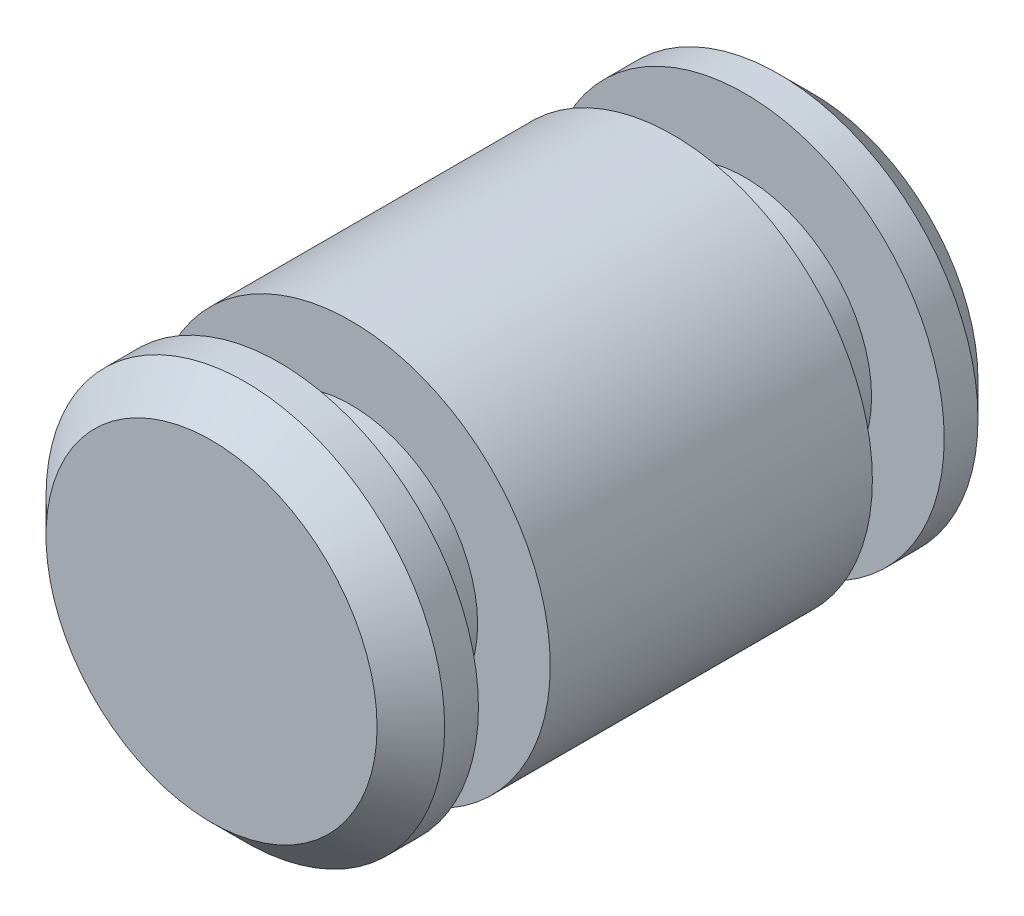
ISO-10303-21;
HEADER;
FILE_DESCRIPTION(('STEP AP214'),'2;1');
FILE_NAME('part.step','',(''),(''),'','','');
FILE_SCHEMA(('AUTOMOTIVE_DESIGN { 1 0 10303 214 1 1 1 1 }'));
ENDSEC;
DATA;
#1=APPLICATION_CONTEXT('core data for automotive mechanical design processes');
#2=APPLICATION_PROTOCOL_DEFINITION('international standard','automotive_design',2000,#1);
#3=PRODUCT_CONTEXT('',#1,'mechanical');
#4=PRODUCT('Part','Part','',(#3));
#5=PRODUCT_RELATED_PRODUCT_CATEGORY('part','',(#4));
#6=PRODUCT_DEFINITION_FORMATION('','',#4);
#7=PRODUCT_DEFINITION_CONTEXT('part definition',#1,'design');
#8=PRODUCT_DEFINITION('design','',#6,#7);
#9=PRODUCT_DEFINITION_SHAPE('','',#8);
#10=(LENGTH_UNIT() NAMED_UNIT(*) SI_UNIT(.MILLI.,.METRE.));
#11=(NAMED_UNIT(*) PLANE_ANGLE_UNIT() SI_UNIT($,.RADIAN.));
#12=(NAMED_UNIT(*) SI_UNIT($,.STERADIAN.) SOLID_ANGLE_UNIT());
#13=UNCERTAINTY_MEASURE_WITH_UNIT(LENGTH_MEASURE(1.E-05),#10,'distance_accuracy_value','');
#14=(GEOMETRIC_REPRESENTATION_CONTEXT(3) GLOBAL_UNCERTAINTY_ASSIGNED_CONTEXT((#13)) GLOBAL_UNIT_ASSIGNED_CONTEXT((#10,
#11,#12)) REPRESENTATION_CONTEXT('',''));
#15=CARTESIAN_POINT('',(0.,0.,0.));
#16=DIRECTION('',(0.,0.,1.));
#17=DIRECTION('',(1.,0.,0.));
#18=AXIS2_PLACEMENT_3D('',#15,#16,#17);
#19=CARTESIAN_POINT('',(0.,0.,2.2590125));
#20=DIRECTION('',(0.,0.,-1.));
#21=DIRECTION('',(-1.,0.,0.));
#22=AXIS2_PLACEMENT_3D('',#19,#20,#21);
#23=CYLINDRICAL_SURFACE('',#22,1.4986);
#24=CARTESIAN_POINT('',(0.,0.,-1.2110085));
#25=DIRECTION('',(0.,0.,1.));
#26=DIRECTION('',(1.,0.,0.));
#27=AXIS2_PLACEMENT_3D('',#24,#25,#26);
#28=CIRCLE('',#27,1.4986);
#29=CARTESIAN_POINT('',(1.4986,0.,-1.2110085));
#30=VERTEX_POINT('',#29);
#31=EDGE_CURVE('E74',#30,#30,#28,.T.);
#32=ORIENTED_EDGE('',*,*,#31,.T.);
#33=EDGE_LOOP('',(#32));
#34=FACE_BOUND('',#33,.T.);
#35=CARTESIAN_POINT('',(0.,0.,1.2110085));
#36=DIRECTION('',(0.,0.,1.));
#37=DIRECTION('',(1.,0.,0.));
#38=AXIS2_PLACEMENT_3D('',#35,#36,#37);
#39=CIRCLE('',#38,1.4986);
#40=CARTESIAN_POINT('',(1.4986,0.,1.2110085));
#41=VERTEX_POINT('',#40);
#42=EDGE_CURVE('E66',#41,#41,#39,.T.);
#43=ORIENTED_EDGE('',*,*,#42,.F.);
#44=EDGE_LOOP('',(#43));
#45=FACE_BOUND('',#44,.T.);
#46=ADVANCED_FACE('F32',(#34,#45),#23,.T.);
#47=CARTESIAN_POINT('',(0.,0.,2.0050125));
#48=DIRECTION('',(0.,0.,1.));
#49=DIRECTION('',(1.,0.,0.));
#50=AXIS2_PLACEMENT_3D('',#47,#48,#49);
#51=CIRCLE('',#50,1.4986);
#52=CARTESIAN_POINT('',(1.4986,0.,2.0050125));
#53=VERTEX_POINT('',#52);
#54=EDGE_CURVE('E10',#53,#53,#51,.F.);
#55=ORIENTED_EDGE('',*,*,#54,.T.);
#56=EDGE_LOOP('',(#55));
#57=FACE_BOUND('',#56,.T.);
#58=CARTESIAN_POINT('',(0.,0.,1.7510125));
#59=DIRECTION('',(0.,0.,1.));
#60=DIRECTION('',(1.,0.,0.));
#61=AXIS2_PLACEMENT_3D('',#58,#59,#60);
#62=CIRCLE('',#61,1.4986);
#63=CARTESIAN_POINT('',(1.4986,0.,1.7510125));
#64=VERTEX_POINT('',#63);
#65=EDGE_CURVE('E70',#64,#64,#62,.T.);
#66=ORIENTED_EDGE('',*,*,#65,.T.);
#67=EDGE_LOOP('',(#66));
#68=FACE_BOUND('',#67,.T.);
#69=ADVANCED_FACE('F100',(#57,#68),#23,.T.);
#70=CARTESIAN_POINT('',(0.,0.,2.2590125));
#71=DIRECTION('',(0.,0.,1.));
#72=DIRECTION('',(1.,0.,0.));
#73=AXIS2_PLACEMENT_3D('',#70,#71,#72);
#74=PLANE('',#73);
#75=CARTESIAN_POINT('',(0.,0.,2.2590125));
#76=DIRECTION('',(0.,0.,1.));
#77=DIRECTION('',(1.,0.,0.));
#78=AXIS2_PLACEMENT_3D('',#75,#76,#77);
#79=CIRCLE('',#78,1.2446);
#80=CARTESIAN_POINT('',(1.2446,0.,2.2590125));
#81=VERTEX_POINT('',#80);
#82=EDGE_CURVE('E40',#81,#81,#79,.T.);
#83=ORIENTED_EDGE('',*,*,#82,.T.);
#84=EDGE_LOOP('',(#83));
#85=FACE_BOUND('',#84,.T.);
#86=ADVANCED_FACE('F111',(#85),#74,.T.);
#87=CARTESIAN_POINT('',(0.,-1.49859999999995,1.7510125));
#88=DIRECTION('',(0.,0.,1.));
#89=DIRECTION('',(1.,0.,0.));
#90=AXIS2_PLACEMENT_3D('',#87,#88,#89);
#91=PLANE('',#90);
#92=ORIENTED_EDGE('',*,*,#65,.F.);
#93=EDGE_LOOP('',(#92));
#94=FACE_BOUND('',#93,.T.);
#95=CARTESIAN_POINT('',(0.,0.,1.7510125));
#96=DIRECTION('',(0.,0.,1.));
#97=DIRECTION('',(1.,0.,0.));
#98=AXIS2_PLACEMENT_3D('',#95,#96,#97);
#99=CIRCLE('',#98,0.9525);
#100=CARTESIAN_POINT('',(0.9525,0.,1.7510125));
#101=VERTEX_POINT('',#100);
#102=EDGE_CURVE('E58',#101,#101,#99,.T.);
#103=ORIENTED_EDGE('',*,*,#102,.T.);
#104=EDGE_LOOP('',(#103));
#105=FACE_BOUND('',#104,.T.);
#106=ADVANCED_FACE('F115',(#94,#105),#91,.F.);
#107=CARTESIAN_POINT('',(0.,0.,8.82803245544554));
#108=DIRECTION('',(0.,0.,1.));
#109=DIRECTION('',(1.,0.,0.));
#110=AXIS2_PLACEMENT_3D('',#107,#108,#109);
#111=CYLINDRICAL_SURFACE('',#110,0.9525);
#112=ORIENTED_EDGE('',*,*,#102,.F.);
#113=EDGE_LOOP('',(#112));
#114=FACE_BOUND('',#113,.T.);
#115=CARTESIAN_POINT('',(0.,0.,1.2110085));
#116=DIRECTION('',(0.,0.,1.));
#117=DIRECTION('',(1.,0.,0.));
#118=AXIS2_PLACEMENT_3D('',#115,#116,#117);
#119=CIRCLE('',#118,0.9525);
#120=CARTESIAN_POINT('',(0.9525,0.,1.2110085));
#121=VERTEX_POINT('',#120);
#122=EDGE_CURVE('E62',#121,#121,#119,.T.);
#123=ORIENTED_EDGE('',*,*,#122,.T.);
#124=EDGE_LOOP('',(#123));
#125=FACE_BOUND('',#124,.T.);
#126=ADVANCED_FACE('F122',(#114,#125),#111,.T.);
#127=CARTESIAN_POINT('',(-1.94289029309402E-13,-1.49859999999991,1.2110085));
#128=DIRECTION('',(0.,0.,-1.));
#129=DIRECTION('',(-1.,0.,0.));
#130=AXIS2_PLACEMENT_3D('',#127,#128,#129);
#131=PLANE('',#130);
#132=ORIENTED_EDGE('',*,*,#122,.F.);
#133=EDGE_LOOP('',(#132));
#134=FACE_BOUND('',#133,.T.);
#135=ORIENTED_EDGE('',*,*,#42,.T.);
#136=EDGE_LOOP('',(#135));
#137=FACE_BOUND('',#136,.T.);
#138=ADVANCED_FACE('F128',(#134,#137),#131,.F.);
#139=CARTESIAN_POINT('',(-3.88578058618805E-13,-1.49859999999994,-1.2110085));
#140=DIRECTION('',(0.,0.,1.));
#141=DIRECTION('',(1.,0.,0.));
#142=AXIS2_PLACEMENT_3D('',#139,#140,#141);
#143=PLANE('',#142);
#144=ORIENTED_EDGE('',*,*,#31,.F.);
#145=EDGE_LOOP('',(#144));
#146=FACE_BOUND('',#145,.T.);
#147=CARTESIAN_POINT('',(0.,0.,-1.2110085));
#148=DIRECTION('',(0.,0.,1.));
#149=DIRECTION('',(1.,0.,0.));
#150=AXIS2_PLACEMENT_3D('',#147,#148,#149);
#151=CIRCLE('',#150,0.9525);
#152=CARTESIAN_POINT('',(0.9525,0.,-1.2110085));
#153=VERTEX_POINT('',#152);
#154=EDGE_CURVE('E78',#153,#153,#151,.T.);
#155=ORIENTED_EDGE('',*,*,#154,.T.);
#156=EDGE_LOOP('',(#155));
#157=FACE_BOUND('',#156,.T.);
#158=ADVANCED_FACE('F134',(#146,#157),#143,.F.);
#159=CARTESIAN_POINT('',(0.,0.,8.82803245544554));
#160=DIRECTION('',(0.,0.,1.));
#161=DIRECTION('',(1.,0.,0.));
#162=AXIS2_PLACEMENT_3D('',#159,#160,#161);
#163=CYLINDRICAL_SURFACE('',#162,0.9525);
#164=ORIENTED_EDGE('',*,*,#154,.F.);
#165=EDGE_LOOP('',(#164));
#166=FACE_BOUND('',#165,.T.);
#167=CARTESIAN_POINT('',(0.,0.,-1.75101250000001));
#168=DIRECTION('',(0.,0.,1.));
#169=DIRECTION('',(1.,0.,0.));
#170=AXIS2_PLACEMENT_3D('',#167,#168,#169);
#171=CIRCLE('',#170,0.952499999999999);
#172=CARTESIAN_POINT('',(0.952499999999999,0.,-1.75101250000001));
#173=VERTEX_POINT('',#172);
#174=EDGE_CURVE('E82',#173,#173,#171,.T.);
#175=ORIENTED_EDGE('',*,*,#174,.T.);
#176=EDGE_LOOP('',(#175));
#177=FACE_BOUND('',#176,.T.);
#178=ADVANCED_FACE('F141',(#166,#177),#163,.T.);
#179=CARTESIAN_POINT('',(-3.88578058618805E-13,-1.49859999999994,-1.75101250000001));
#180=DIRECTION('',(0.,0.,-1.));
#181=DIRECTION('',(-1.,0.,0.));
#182=AXIS2_PLACEMENT_3D('',#179,#180,#181);
#183=PLANE('',#182);
#184=ORIENTED_EDGE('',*,*,#174,.F.);
#185=EDGE_LOOP('',(#184));
#186=FACE_BOUND('',#185,.T.);
#187=CARTESIAN_POINT('',(0.,0.,-1.75101250000001));
#188=DIRECTION('',(0.,0.,1.));
#189=DIRECTION('',(1.,0.,0.));
#190=AXIS2_PLACEMENT_3D('',#187,#188,#189);
#191=CIRCLE('',#190,1.4986);
#192=CARTESIAN_POINT('',(1.4986,0.,-1.75101250000001));
#193=VERTEX_POINT('',#192);
#194=EDGE_CURVE('E86',#193,#193,#191,.T.);
#195=ORIENTED_EDGE('',*,*,#194,.T.);
#196=EDGE_LOOP('',(#195));
#197=FACE_BOUND('',#196,.T.);
#198=ADVANCED_FACE('F92',(#186,#197),#183,.F.);
#199=CARTESIAN_POINT('',(0.,0.,-2.25901249999999));
#200=DIRECTION('',(0.,0.,1.));
#201=DIRECTION('',(1.,0.,0.));
#202=AXIS2_PLACEMENT_3D('',#199,#200,#201);
#203=PLANE('',#202);
#204=CARTESIAN_POINT('',(0.,0.,-2.25901249999999));
#205=DIRECTION('',(0.,0.,1.));
#206=DIRECTION('',(1.,0.,0.));
#207=AXIS2_PLACEMENT_3D('',#204,#205,#206);
#208=CIRCLE('',#207,1.2446);
#209=CARTESIAN_POINT('',(1.2446,0.,-2.25901249999999));
#210=VERTEX_POINT('',#209);
#211=EDGE_CURVE('E46',#210,#210,#208,.F.);
#212=ORIENTED_EDGE('',*,*,#211,.T.);
#213=EDGE_LOOP('',(#212));
#214=FACE_BOUND('',#213,.T.);
#215=ADVANCED_FACE('F97',(#214),#203,.F.);
#216=CARTESIAN_POINT('',(0.,0.,-2.0050125));
#217=DIRECTION('',(0.,0.,1.));
#218=DIRECTION('',(1.,0.,0.));
#219=AXIS2_PLACEMENT_3D('',#216,#217,#218);
#220=CIRCLE('',#219,1.4986);
#221=CARTESIAN_POINT('',(1.4986,0.,-2.0050125));
#222=VERTEX_POINT('',#221);
#223=EDGE_CURVE('E52',#222,#222,#220,.T.);
#224=ORIENTED_EDGE('',*,*,#223,.T.);
#225=EDGE_LOOP('',(#224));
#226=FACE_BOUND('',#225,.T.);
#227=ORIENTED_EDGE('',*,*,#194,.F.);
#228=EDGE_LOOP('',(#227));
#229=FACE_BOUND('',#228,.T.);
#230=ADVANCED_FACE('F94',(#226,#229),#23,.T.);
#231=CARTESIAN_POINT('',(0.,0.,-2.0050125));
#232=DIRECTION('',(0.,0.,1.));
#233=DIRECTION('',(1.,0.,0.));
#234=AXIS2_PLACEMENT_3D('',#231,#232,#233);
#235=CONICAL_SURFACE('',#234,1.4986,0.785398163397449);
#236=ORIENTED_EDGE('',*,*,#211,.F.);
#237=EDGE_LOOP('',(#236));
#238=FACE_BOUND('',#237,.T.);
#239=ORIENTED_EDGE('',*,*,#223,.F.);
#240=EDGE_LOOP('',(#239));
#241=FACE_BOUND('',#240,.T.);
#242=ADVANCED_FACE('F96',(#238,#241),#235,.T.);
#243=CARTESIAN_POINT('',(0.,0.,2.2590125));
#244=DIRECTION('',(0.,0.,-1.));
#245=DIRECTION('',(-1.,0.,0.));
#246=AXIS2_PLACEMENT_3D('',#243,#244,#245);
#247=CONICAL_SURFACE('',#246,1.2446,0.785398163397445);
#248=ORIENTED_EDGE('',*,*,#54,.F.);
#249=EDGE_LOOP('',(#248));
#250=FACE_BOUND('',#249,.T.);
#251=ORIENTED_EDGE('',*,*,#82,.F.);
#252=EDGE_LOOP('',(#251));
#253=FACE_BOUND('',#252,.T.);
#254=ADVANCED_FACE('F34',(#250,#253),#247,.T.);
#255=CLOSED_SHELL('',(#46,#69,#86,#106,#126,#138,#158,#178,#198,#215,#230,#242,#254));
#256=MANIFOLD_SOLID_BREP('B2',#255);
#257=ADVANCED_BREP_SHAPE_REPRESENTATION('',(#18,#256),#14);
#258=SHAPE_DEFINITION_REPRESENTATION(#9,#257);
ENDSEC;
END-ISO-10303-21;
